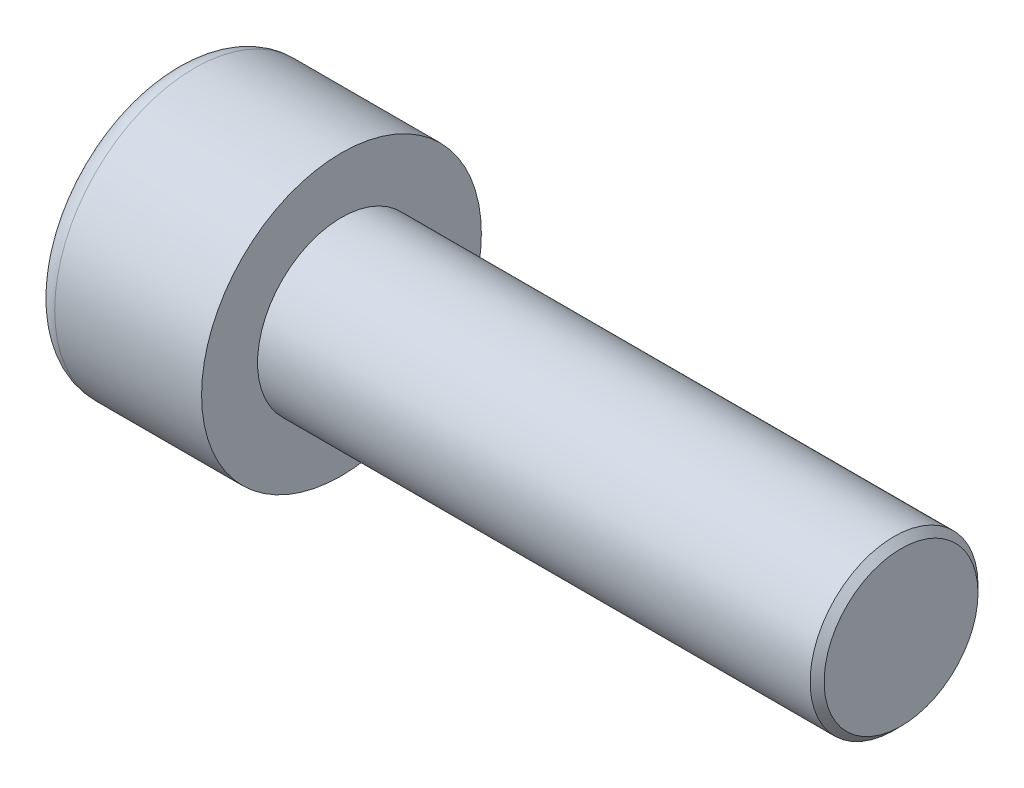
ISO-10303-21;
HEADER;
FILE_DESCRIPTION(('STEP AP214'),'2;1');
FILE_NAME('part.step','',(''),(''),'','','');
FILE_SCHEMA(('AUTOMOTIVE_DESIGN { 1 0 10303 214 1 1 1 1 }'));
ENDSEC;
DATA;
#1=APPLICATION_CONTEXT('core data for automotive mechanical design processes');
#2=APPLICATION_PROTOCOL_DEFINITION('international standard','automotive_design',2000,#1);
#3=PRODUCT_CONTEXT('',#1,'mechanical');
#4=PRODUCT('Part','Part','',(#3));
#5=PRODUCT_RELATED_PRODUCT_CATEGORY('part','',(#4));
#6=PRODUCT_DEFINITION_FORMATION('','',#4);
#7=PRODUCT_DEFINITION_CONTEXT('part definition',#1,'design');
#8=PRODUCT_DEFINITION('design','',#6,#7);
#9=PRODUCT_DEFINITION_SHAPE('','',#8);
#10=(LENGTH_UNIT() NAMED_UNIT(*) SI_UNIT(.MILLI.,.METRE.));
#11=(NAMED_UNIT(*) PLANE_ANGLE_UNIT() SI_UNIT($,.RADIAN.));
#12=(NAMED_UNIT(*) SI_UNIT($,.STERADIAN.) SOLID_ANGLE_UNIT());
#13=UNCERTAINTY_MEASURE_WITH_UNIT(LENGTH_MEASURE(1.E-05),#10,'distance_accuracy_value','');
#14=(GEOMETRIC_REPRESENTATION_CONTEXT(3) GLOBAL_UNCERTAINTY_ASSIGNED_CONTEXT((#13)) GLOBAL_UNIT_ASSIGNED_CONTEXT((#10,
#11,#12)) REPRESENTATION_CONTEXT('',''));
#15=CARTESIAN_POINT('',(0.,0.,0.));
#16=DIRECTION('',(0.,0.,1.));
#17=DIRECTION('',(1.,0.,0.));
#18=AXIS2_PLACEMENT_3D('',#15,#16,#17);
#19=CARTESIAN_POINT('',(3.,-5.,0.));
#20=DIRECTION('',(-1.,0.,0.));
#21=DIRECTION('',(0.,0.,1.));
#22=AXIS2_PLACEMENT_3D('',#19,#20,#21);
#23=PLANE('',#22);
#24=DIRECTION('',(0.,-0.866025403784438,-0.5));
#25=VECTOR('',#24,1.);
#26=CARTESIAN_POINT('',(3.,0.,2.88675134594813));
#27=LINE('',#26,#25);
#28=CARTESIAN_POINT('',(3.,-1.25,2.1650635094611));
#29=VERTEX_POINT('',#28);
#30=CARTESIAN_POINT('',(3.,-2.5,1.44337567297407));
#31=VERTEX_POINT('',#30);
#32=EDGE_CURVE('E157',#29,#31,#27,.T.);
#33=ORIENTED_EDGE('',*,*,#32,.F.);
#34=CARTESIAN_POINT('',(3.,0.,0.));
#35=DIRECTION('',(-1.,0.,0.));
#36=DIRECTION('',(0.,0.,1.));
#37=AXIS2_PLACEMENT_3D('',#34,#35,#36);
#38=CIRCLE('',#37,2.5);
#39=CARTESIAN_POINT('',(3.,-2.5,0.));
#40=VERTEX_POINT('',#39);
#41=EDGE_CURVE('E52',#29,#40,#38,.F.);
#42=ORIENTED_EDGE('',*,*,#41,.T.);
#43=DIRECTION('',(0.,0.,-1.));
#44=VECTOR('',#43,1.);
#45=CARTESIAN_POINT('',(3.,-2.5,1.44337567297407));
#46=LINE('',#45,#44);
#47=EDGE_CURVE('E162',#31,#40,#46,.T.);
#48=ORIENTED_EDGE('',*,*,#47,.F.);
#49=EDGE_LOOP('',(#33,#42,#48));
#50=FACE_BOUND('',#49,.T.);
#51=ADVANCED_FACE('F37',(#50),#23,.T.);
#52=CARTESIAN_POINT('',(3.,-2.5,-1.44337567297406));
#53=VERTEX_POINT('',#52);
#54=EDGE_CURVE('E161',#40,#53,#46,.T.);
#55=ORIENTED_EDGE('',*,*,#54,.F.);
#56=CARTESIAN_POINT('',(3.,-1.25,-2.1650635094611));
#57=VERTEX_POINT('',#56);
#58=EDGE_CURVE('E137',#40,#57,#38,.F.);
#59=ORIENTED_EDGE('',*,*,#58,.T.);
#60=DIRECTION('',(0.,0.866025403784439,-0.5));
#61=VECTOR('',#60,1.);
#62=CARTESIAN_POINT('',(3.,-2.5,-1.44337567297406));
#63=LINE('',#62,#61);
#64=EDGE_CURVE('E145',#53,#57,#63,.T.);
#65=ORIENTED_EDGE('',*,*,#64,.F.);
#66=EDGE_LOOP('',(#55,#59,#65));
#67=FACE_BOUND('',#66,.T.);
#68=ADVANCED_FACE('F218',(#67),#23,.T.);
#69=CARTESIAN_POINT('',(3.,0.,-2.88675134594813));
#70=VERTEX_POINT('',#69);
#71=EDGE_CURVE('E135',#57,#70,#63,.T.);
#72=ORIENTED_EDGE('',*,*,#71,.F.);
#73=CARTESIAN_POINT('',(3.,1.25,-2.1650635094611));
#74=VERTEX_POINT('',#73);
#75=EDGE_CURVE('E119',#57,#74,#38,.F.);
#76=ORIENTED_EDGE('',*,*,#75,.T.);
#77=DIRECTION('',(0.,0.866025403784439,0.5));
#78=VECTOR('',#77,1.);
#79=CARTESIAN_POINT('',(3.,0.,-2.88675134594813));
#80=LINE('',#79,#78);
#81=EDGE_CURVE('E133',#70,#74,#80,.T.);
#82=ORIENTED_EDGE('',*,*,#81,.F.);
#83=EDGE_LOOP('',(#72,#76,#82));
#84=FACE_BOUND('',#83,.T.);
#85=ADVANCED_FACE('F131',(#84),#23,.T.);
#86=CARTESIAN_POINT('',(3.,2.5,-1.44337567297406));
#87=VERTEX_POINT('',#86);
#88=EDGE_CURVE('E139',#74,#87,#80,.T.);
#89=ORIENTED_EDGE('',*,*,#88,.F.);
#90=CARTESIAN_POINT('',(3.,0.,0.));
#91=DIRECTION('',(1.,0.,0.));
#92=DIRECTION('',(0.,0.,-1.));
#93=AXIS2_PLACEMENT_3D('',#90,#91,#92);
#94=CIRCLE('',#93,2.5);
#95=CARTESIAN_POINT('',(3.,2.5,0.));
#96=VERTEX_POINT('',#95);
#97=EDGE_CURVE('E117',#74,#96,#94,.T.);
#98=ORIENTED_EDGE('',*,*,#97,.T.);
#99=DIRECTION('',(0.,0.,1.));
#100=VECTOR('',#99,1.);
#101=CARTESIAN_POINT('',(3.,2.5,-1.44337567297406));
#102=LINE('',#101,#100);
#103=EDGE_CURVE('E142',#87,#96,#102,.T.);
#104=ORIENTED_EDGE('',*,*,#103,.F.);
#105=EDGE_LOOP('',(#89,#98,#104));
#106=FACE_BOUND('',#105,.T.);
#107=ADVANCED_FACE('F140',(#106),#23,.T.);
#108=CARTESIAN_POINT('',(3.,2.5,1.44337567297407));
#109=VERTEX_POINT('',#108);
#110=EDGE_CURVE('E149',#96,#109,#102,.T.);
#111=ORIENTED_EDGE('',*,*,#110,.F.);
#112=CARTESIAN_POINT('',(3.,1.25,2.1650635094611));
#113=VERTEX_POINT('',#112);
#114=EDGE_CURVE('E122',#96,#113,#38,.F.);
#115=ORIENTED_EDGE('',*,*,#114,.T.);
#116=DIRECTION('',(0.,-0.866025403784439,0.5));
#117=VECTOR('',#116,1.);
#118=CARTESIAN_POINT('',(3.,2.5,1.44337567297407));
#119=LINE('',#118,#117);
#120=EDGE_CURVE('E154',#109,#113,#119,.T.);
#121=ORIENTED_EDGE('',*,*,#120,.F.);
#122=EDGE_LOOP('',(#111,#115,#121));
#123=FACE_BOUND('',#122,.T.);
#124=ADVANCED_FACE('F230',(#123),#23,.T.);
#125=CARTESIAN_POINT('',(3.,0.,2.88675134594813));
#126=VERTEX_POINT('',#125);
#127=EDGE_CURVE('E153',#113,#126,#119,.T.);
#128=ORIENTED_EDGE('',*,*,#127,.F.);
#129=EDGE_CURVE('E198',#113,#29,#38,.F.);
#130=ORIENTED_EDGE('',*,*,#129,.T.);
#131=EDGE_CURVE('E158',#126,#29,#27,.T.);
#132=ORIENTED_EDGE('',*,*,#131,.F.);
#133=EDGE_LOOP('',(#128,#130,#132));
#134=FACE_BOUND('',#133,.T.);
#135=ADVANCED_FACE('F221',(#134),#23,.T.);
#136=CARTESIAN_POINT('',(0.,0.,0.));
#137=DIRECTION('',(1.,0.,0.));
#138=DIRECTION('',(0.,0.,-1.));
#139=AXIS2_PLACEMENT_3D('',#136,#137,#138);
#140=PLANE('',#139);
#141=CARTESIAN_POINT('',(0.,0.,0.));
#142=DIRECTION('',(1.,0.,0.));
#143=DIRECTION('',(0.,0.,-1.));
#144=AXIS2_PLACEMENT_3D('',#141,#142,#143);
#145=CIRCLE('',#144,4.25);
#146=CARTESIAN_POINT('',(0.,0.,-4.25));
#147=VERTEX_POINT('',#146);
#148=EDGE_CURVE('E203',#147,#147,#145,.F.);
#149=ORIENTED_EDGE('',*,*,#148,.T.);
#150=EDGE_LOOP('',(#149));
#151=FACE_BOUND('',#150,.T.);
#152=DIRECTION('',(0.,0.866025403784439,-0.5));
#153=VECTOR('',#152,1.);
#154=CARTESIAN_POINT('',(0.,-2.5,-1.44337567297406));
#155=LINE('',#154,#153);
#156=CARTESIAN_POINT('',(0.,-2.5,-1.44337567297406));
#157=VERTEX_POINT('',#156);
#158=CARTESIAN_POINT('',(0.,0.,-2.88675134594813));
#159=VERTEX_POINT('',#158);
#160=EDGE_CURVE('E60',#157,#159,#155,.T.);
#161=ORIENTED_EDGE('',*,*,#160,.T.);
#162=DIRECTION('',(0.,0.866025403784439,0.5));
#163=VECTOR('',#162,1.);
#164=CARTESIAN_POINT('',(0.,0.,-2.88675134594813));
#165=LINE('',#164,#163);
#166=CARTESIAN_POINT('',(0.,2.5,-1.44337567297406));
#167=VERTEX_POINT('',#166);
#168=EDGE_CURVE('E167',#159,#167,#165,.T.);
#169=ORIENTED_EDGE('',*,*,#168,.T.);
#170=DIRECTION('',(0.,0.,1.));
#171=VECTOR('',#170,1.);
#172=CARTESIAN_POINT('',(0.,2.5,-1.44337567297406));
#173=LINE('',#172,#171);
#174=CARTESIAN_POINT('',(0.,2.5,1.44337567297407));
#175=VERTEX_POINT('',#174);
#176=EDGE_CURVE('E170',#167,#175,#173,.T.);
#177=ORIENTED_EDGE('',*,*,#176,.T.);
#178=DIRECTION('',(0.,-0.866025403784439,0.5));
#179=VECTOR('',#178,1.);
#180=CARTESIAN_POINT('',(0.,2.5,1.44337567297407));
#181=LINE('',#180,#179);
#182=CARTESIAN_POINT('',(0.,0.,2.88675134594813));
#183=VERTEX_POINT('',#182);
#184=EDGE_CURVE('E173',#175,#183,#181,.T.);
#185=ORIENTED_EDGE('',*,*,#184,.T.);
#186=DIRECTION('',(0.,-0.866025403784438,-0.5));
#187=VECTOR('',#186,1.);
#188=CARTESIAN_POINT('',(0.,0.,2.88675134594813));
#189=LINE('',#188,#187);
#190=CARTESIAN_POINT('',(0.,-2.5,1.44337567297407));
#191=VERTEX_POINT('',#190);
#192=EDGE_CURVE('E176',#183,#191,#189,.T.);
#193=ORIENTED_EDGE('',*,*,#192,.T.);
#194=DIRECTION('',(0.,0.,-1.));
#195=VECTOR('',#194,1.);
#196=CARTESIAN_POINT('',(0.,-2.5,1.44337567297407));
#197=LINE('',#196,#195);
#198=EDGE_CURVE('E179',#191,#157,#197,.T.);
#199=ORIENTED_EDGE('',*,*,#198,.T.);
#200=EDGE_LOOP('',(#161,#169,#177,#185,#193,#199));
#201=FACE_BOUND('',#200,.T.);
#202=ADVANCED_FACE('F229',(#151,#201),#140,.F.);
#203=CARTESIAN_POINT('',(6.,0.,0.));
#204=DIRECTION('',(1.,0.,0.));
#205=DIRECTION('',(0.,0.,-1.));
#206=AXIS2_PLACEMENT_3D('',#203,#204,#205);
#207=PLANE('',#206);
#208=CARTESIAN_POINT('',(6.,0.,0.));
#209=DIRECTION('',(1.,0.,0.));
#210=DIRECTION('',(0.,0.,-1.));
#211=AXIS2_PLACEMENT_3D('',#208,#209,#210);
#212=CIRCLE('',#211,5.);
#213=CARTESIAN_POINT('',(6.,0.,-5.));
#214=VERTEX_POINT('',#213);
#215=EDGE_CURVE('E195',#214,#214,#212,.T.);
#216=ORIENTED_EDGE('',*,*,#215,.T.);
#217=EDGE_LOOP('',(#216));
#218=FACE_BOUND('',#217,.T.);
#219=CARTESIAN_POINT('',(6.,0.,0.));
#220=DIRECTION('',(1.,0.,0.));
#221=DIRECTION('',(0.,0.,-1.));
#222=AXIS2_PLACEMENT_3D('',#219,#220,#221);
#223=CIRCLE('',#222,3.);
#224=CARTESIAN_POINT('',(6.,0.,-3.));
#225=VERTEX_POINT('',#224);
#226=EDGE_CURVE('E192',#225,#225,#223,.T.);
#227=ORIENTED_EDGE('',*,*,#226,.F.);
#228=EDGE_LOOP('',(#227));
#229=FACE_BOUND('',#228,.T.);
#230=ADVANCED_FACE('F236',(#218,#229),#207,.T.);
#231=CARTESIAN_POINT('',(6.,0.,0.));
#232=DIRECTION('',(-1.,0.,0.));
#233=DIRECTION('',(0.,0.,1.));
#234=AXIS2_PLACEMENT_3D('',#231,#232,#233);
#235=CYLINDRICAL_SURFACE('',#234,5.);
#236=CARTESIAN_POINT('',(0.75,0.,0.));
#237=DIRECTION('',(1.,0.,0.));
#238=DIRECTION('',(0.,0.,-1.));
#239=AXIS2_PLACEMENT_3D('',#236,#237,#238);
#240=CIRCLE('',#239,5.);
#241=CARTESIAN_POINT('',(0.75,0.,-5.));
#242=VERTEX_POINT('',#241);
#243=EDGE_CURVE('E200',#242,#242,#240,.T.);
#244=ORIENTED_EDGE('',*,*,#243,.T.);
#245=EDGE_LOOP('',(#244));
#246=FACE_BOUND('',#245,.T.);
#247=ORIENTED_EDGE('',*,*,#215,.F.);
#248=EDGE_LOOP('',(#247));
#249=FACE_BOUND('',#248,.T.);
#250=ADVANCED_FACE('F281',(#246,#249),#235,.T.);
#251=CARTESIAN_POINT('',(26.,0.,0.));
#252=DIRECTION('',(-1.,0.,0.));
#253=DIRECTION('',(0.,0.,1.));
#254=AXIS2_PLACEMENT_3D('',#251,#252,#253);
#255=CYLINDRICAL_SURFACE('',#254,3.);
#256=CARTESIAN_POINT('',(25.75,0.,0.));
#257=DIRECTION('',(1.,0.,0.));
#258=DIRECTION('',(0.,0.,-1.));
#259=AXIS2_PLACEMENT_3D('',#256,#257,#258);
#260=CIRCLE('',#259,3.);
#261=CARTESIAN_POINT('',(25.75,0.,-3.));
#262=VERTEX_POINT('',#261);
#263=EDGE_CURVE('E11',#262,#262,#260,.F.);
#264=ORIENTED_EDGE('',*,*,#263,.T.);
#265=EDGE_LOOP('',(#264));
#266=FACE_BOUND('',#265,.T.);
#267=ORIENTED_EDGE('',*,*,#226,.T.);
#268=EDGE_LOOP('',(#267));
#269=FACE_BOUND('',#268,.T.);
#270=ADVANCED_FACE('F278',(#266,#269),#255,.T.);
#271=CARTESIAN_POINT('',(26.,0.,0.));
#272=DIRECTION('',(1.,0.,0.));
#273=DIRECTION('',(0.,0.,-1.));
#274=AXIS2_PLACEMENT_3D('',#271,#272,#273);
#275=PLANE('',#274);
#276=CARTESIAN_POINT('',(26.,0.,0.));
#277=DIRECTION('',(1.,0.,0.));
#278=DIRECTION('',(0.,0.,-1.));
#279=AXIS2_PLACEMENT_3D('',#276,#277,#278);
#280=CIRCLE('',#279,2.75);
#281=CARTESIAN_POINT('',(26.,0.,-2.75));
#282=VERTEX_POINT('',#281);
#283=EDGE_CURVE('E45',#282,#282,#280,.T.);
#284=ORIENTED_EDGE('',*,*,#283,.T.);
#285=EDGE_LOOP('',(#284));
#286=FACE_BOUND('',#285,.T.);
#287=ADVANCED_FACE('F208',(#286),#275,.T.);
#288=CARTESIAN_POINT('',(3.,-2.5,-1.44337567297406));
#289=DIRECTION('',(0.,0.5,0.866025403784439));
#290=DIRECTION('',(0.,-0.866025403784439,0.5));
#291=AXIS2_PLACEMENT_3D('',#288,#289,#290);
#292=PLANE('',#291);
#293=ORIENTED_EDGE('',*,*,#160,.F.);
#294=DIRECTION('',(-1.,0.,0.));
#295=VECTOR('',#294,1.);
#296=CARTESIAN_POINT('',(3.,-2.5,-1.44337567297406));
#297=LINE('',#296,#295);
#298=EDGE_CURVE('E165',#53,#157,#297,.T.);
#299=ORIENTED_EDGE('',*,*,#298,.F.);
#300=ORIENTED_EDGE('',*,*,#64,.T.);
#301=ORIENTED_EDGE('',*,*,#71,.T.);
#302=DIRECTION('',(-1.,0.,0.));
#303=VECTOR('',#302,1.);
#304=CARTESIAN_POINT('',(3.,0.,-2.88675134594813));
#305=LINE('',#304,#303);
#306=EDGE_CURVE('E148',#70,#159,#305,.T.);
#307=ORIENTED_EDGE('',*,*,#306,.T.);
#308=EDGE_LOOP('',(#293,#299,#300,#301,#307));
#309=FACE_BOUND('',#308,.T.);
#310=ADVANCED_FACE('F252',(#309),#292,.T.);
#311=CARTESIAN_POINT('',(3.,0.,-2.88675134594813));
#312=DIRECTION('',(0.,-0.5,0.866025403784438));
#313=DIRECTION('',(0.,-0.866025403784439,-0.5));
#314=AXIS2_PLACEMENT_3D('',#311,#312,#313);
#315=PLANE('',#314);
#316=ORIENTED_EDGE('',*,*,#168,.F.);
#317=ORIENTED_EDGE('',*,*,#306,.F.);
#318=ORIENTED_EDGE('',*,*,#81,.T.);
#319=ORIENTED_EDGE('',*,*,#88,.T.);
#320=DIRECTION('',(-1.,0.,0.));
#321=VECTOR('',#320,1.);
#322=CARTESIAN_POINT('',(3.,2.5,-1.44337567297406));
#323=LINE('',#322,#321);
#324=EDGE_CURVE('E189',#87,#167,#323,.T.);
#325=ORIENTED_EDGE('',*,*,#324,.T.);
#326=EDGE_LOOP('',(#316,#317,#318,#319,#325));
#327=FACE_BOUND('',#326,.T.);
#328=ADVANCED_FACE('F147',(#327),#315,.T.);
#329=CARTESIAN_POINT('',(3.,2.5,-1.44337567297406));
#330=DIRECTION('',(0.,-1.,0.));
#331=DIRECTION('',(0.,0.,-1.));
#332=AXIS2_PLACEMENT_3D('',#329,#330,#331);
#333=PLANE('',#332);
#334=ORIENTED_EDGE('',*,*,#176,.F.);
#335=ORIENTED_EDGE('',*,*,#324,.F.);
#336=ORIENTED_EDGE('',*,*,#103,.T.);
#337=ORIENTED_EDGE('',*,*,#110,.T.);
#338=DIRECTION('',(-1.,0.,0.));
#339=VECTOR('',#338,1.);
#340=CARTESIAN_POINT('',(3.,2.5,1.44337567297407));
#341=LINE('',#340,#339);
#342=EDGE_CURVE('E187',#109,#175,#341,.T.);
#343=ORIENTED_EDGE('',*,*,#342,.T.);
#344=EDGE_LOOP('',(#334,#335,#336,#337,#343));
#345=FACE_BOUND('',#344,.T.);
#346=ADVANCED_FACE('F250',(#345),#333,.T.);
#347=CARTESIAN_POINT('',(3.,2.5,1.44337567297407));
#348=DIRECTION('',(0.,-0.5,-0.866025403784439));
#349=DIRECTION('',(0.,0.866025403784439,-0.5));
#350=AXIS2_PLACEMENT_3D('',#347,#348,#349);
#351=PLANE('',#350);
#352=ORIENTED_EDGE('',*,*,#184,.F.);
#353=ORIENTED_EDGE('',*,*,#342,.F.);
#354=ORIENTED_EDGE('',*,*,#120,.T.);
#355=ORIENTED_EDGE('',*,*,#127,.T.);
#356=DIRECTION('',(-1.,0.,0.));
#357=VECTOR('',#356,1.);
#358=CARTESIAN_POINT('',(3.,0.,2.88675134594813));
#359=LINE('',#358,#357);
#360=EDGE_CURVE('E185',#126,#183,#359,.T.);
#361=ORIENTED_EDGE('',*,*,#360,.T.);
#362=EDGE_LOOP('',(#352,#353,#354,#355,#361));
#363=FACE_BOUND('',#362,.T.);
#364=ADVANCED_FACE('F247',(#363),#351,.T.);
#365=CARTESIAN_POINT('',(3.,0.,2.88675134594813));
#366=DIRECTION('',(0.,0.5,-0.866025403784438));
#367=DIRECTION('',(0.,0.866025403784439,0.5));
#368=AXIS2_PLACEMENT_3D('',#365,#366,#367);
#369=PLANE('',#368);
#370=ORIENTED_EDGE('',*,*,#192,.F.);
#371=ORIENTED_EDGE('',*,*,#360,.F.);
#372=ORIENTED_EDGE('',*,*,#131,.T.);
#373=ORIENTED_EDGE('',*,*,#32,.T.);
#374=DIRECTION('',(-1.,0.,0.));
#375=VECTOR('',#374,1.);
#376=CARTESIAN_POINT('',(3.,-2.5,1.44337567297407));
#377=LINE('',#376,#375);
#378=EDGE_CURVE('E183',#31,#191,#377,.T.);
#379=ORIENTED_EDGE('',*,*,#378,.T.);
#380=EDGE_LOOP('',(#370,#371,#372,#373,#379));
#381=FACE_BOUND('',#380,.T.);
#382=ADVANCED_FACE('F261',(#381),#369,.T.);
#383=CARTESIAN_POINT('',(3.,-2.5,1.44337567297407));
#384=DIRECTION('',(0.,1.,0.));
#385=DIRECTION('',(0.,0.,1.));
#386=AXIS2_PLACEMENT_3D('',#383,#384,#385);
#387=PLANE('',#386);
#388=ORIENTED_EDGE('',*,*,#198,.F.);
#389=ORIENTED_EDGE('',*,*,#378,.F.);
#390=ORIENTED_EDGE('',*,*,#47,.T.);
#391=ORIENTED_EDGE('',*,*,#54,.T.);
#392=ORIENTED_EDGE('',*,*,#298,.T.);
#393=EDGE_LOOP('',(#388,#389,#390,#391,#392));
#394=FACE_BOUND('',#393,.T.);
#395=ADVANCED_FACE('F114',(#394),#387,.T.);
#396=CARTESIAN_POINT('',(3.,0.,0.));
#397=DIRECTION('',(-1.,0.,0.));
#398=DIRECTION('',(0.,0.,1.));
#399=AXIS2_PLACEMENT_3D('',#396,#397,#398);
#400=CONICAL_SURFACE('',#399,2.5,1.04719755119659);
#401=CARTESIAN_POINT('',(4.44337567297408,0.,0.));
#402=VERTEX_POINT('',#401);
#403=VERTEX_LOOP('',#402);
#404=FACE_BOUND('',#403,.T.);
#405=ORIENTED_EDGE('',*,*,#97,.F.);
#406=ORIENTED_EDGE('',*,*,#75,.F.);
#407=ORIENTED_EDGE('',*,*,#58,.F.);
#408=ORIENTED_EDGE('',*,*,#41,.F.);
#409=ORIENTED_EDGE('',*,*,#129,.F.);
#410=ORIENTED_EDGE('',*,*,#114,.F.);
#411=EDGE_LOOP('',(#405,#406,#407,#408,#409,#410));
#412=FACE_BOUND('',#411,.T.);
#413=ADVANCED_FACE('F111',(#404,#412),#400,.F.);
#414=CARTESIAN_POINT('',(0.75,0.,0.));
#415=DIRECTION('',(1.,0.,0.));
#416=DIRECTION('',(0.,0.,-1.));
#417=AXIS2_PLACEMENT_3D('',#414,#415,#416);
#418=TOROIDAL_SURFACE('',#417,4.25,0.75);
#419=ORIENTED_EDGE('',*,*,#148,.F.);
#420=EDGE_LOOP('',(#419));
#421=FACE_BOUND('',#420,.T.);
#422=ORIENTED_EDGE('',*,*,#243,.F.);
#423=EDGE_LOOP('',(#422));
#424=FACE_BOUND('',#423,.T.);
#425=ADVANCED_FACE('F113',(#421,#424),#418,.T.);
#426=CARTESIAN_POINT('',(26.,0.,0.));
#427=DIRECTION('',(-1.,0.,0.));
#428=DIRECTION('',(0.,0.,1.));
#429=AXIS2_PLACEMENT_3D('',#426,#427,#428);
#430=CONICAL_SURFACE('',#429,2.75,0.785398163397451);
#431=ORIENTED_EDGE('',*,*,#263,.F.);
#432=EDGE_LOOP('',(#431));
#433=FACE_BOUND('',#432,.T.);
#434=ORIENTED_EDGE('',*,*,#283,.F.);
#435=EDGE_LOOP('',(#434));
#436=FACE_BOUND('',#435,.T.);
#437=ADVANCED_FACE('F39',(#433,#436),#430,.T.);
#438=CLOSED_SHELL('',(#51,#68,#85,#107,#124,#135,#202,#230,#250,#270,#287,#310,#328,#346,#364,
#382,#395,#413,#425,#437));
#439=MANIFOLD_SOLID_BREP('B2',#438);
#440=ADVANCED_BREP_SHAPE_REPRESENTATION('',(#18,#439),#14);
#441=SHAPE_DEFINITION_REPRESENTATION(#9,#440);
ENDSEC;
END-ISO-10303-21;
